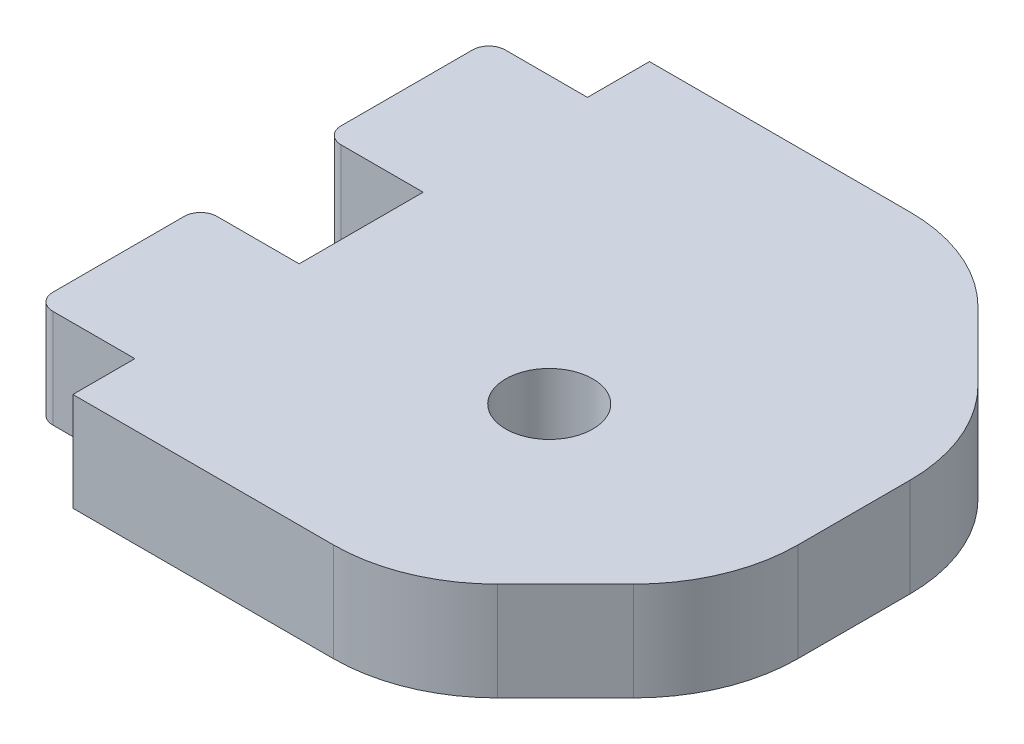
ISO-10303-21;
HEADER;
FILE_DESCRIPTION(('STEP AP214'),'2;1');
FILE_NAME('part.step','',(''),(''),'','','');
FILE_SCHEMA(('AUTOMOTIVE_DESIGN { 1 0 10303 214 1 1 1 1 }'));
ENDSEC;
DATA;
#1=APPLICATION_CONTEXT('core data for automotive mechanical design processes');
#2=APPLICATION_PROTOCOL_DEFINITION('international standard','automotive_design',2000,#1);
#3=PRODUCT_CONTEXT('',#1,'mechanical');
#4=PRODUCT('Part','Part','',(#3));
#5=PRODUCT_RELATED_PRODUCT_CATEGORY('part','',(#4));
#6=PRODUCT_DEFINITION_FORMATION('','',#4);
#7=PRODUCT_DEFINITION_CONTEXT('part definition',#1,'design');
#8=PRODUCT_DEFINITION('design','',#6,#7);
#9=PRODUCT_DEFINITION_SHAPE('','',#8);
#10=(LENGTH_UNIT() NAMED_UNIT(*) SI_UNIT(.MILLI.,.METRE.));
#11=(NAMED_UNIT(*) PLANE_ANGLE_UNIT() SI_UNIT($,.RADIAN.));
#12=(NAMED_UNIT(*) SI_UNIT($,.STERADIAN.) SOLID_ANGLE_UNIT());
#13=UNCERTAINTY_MEASURE_WITH_UNIT(LENGTH_MEASURE(1.E-05),#10,'distance_accuracy_value','');
#14=(GEOMETRIC_REPRESENTATION_CONTEXT(3) GLOBAL_UNCERTAINTY_ASSIGNED_CONTEXT((#13)) GLOBAL_UNIT_ASSIGNED_CONTEXT((#10,
#11,#12)) REPRESENTATION_CONTEXT('',''));
#15=CARTESIAN_POINT('',(0.,0.,0.));
#16=DIRECTION('',(0.,0.,1.));
#17=DIRECTION('',(1.,0.,0.));
#18=AXIS2_PLACEMENT_3D('',#15,#16,#17);
#19=CARTESIAN_POINT('',(0.,6.,0.));
#20=DIRECTION('',(1.,0.,0.));
#21=DIRECTION('',(0.,0.,-1.));
#22=AXIS2_PLACEMENT_3D('',#19,#20,#21);
#23=PLANE('',#22);
#24=DIRECTION('',(0.,1.,0.));
#25=VECTOR('',#24,1.);
#26=CARTESIAN_POINT('',(0.,5.99999999999999,-21.325));
#27=LINE('',#26,#25);
#28=CARTESIAN_POINT('',(0.,0.,-21.325));
#29=VERTEX_POINT('',#28);
#30=CARTESIAN_POINT('',(0.,6.,-21.325));
#31=VERTEX_POINT('',#30);
#32=EDGE_CURVE('E190',#29,#31,#27,.T.);
#33=ORIENTED_EDGE('',*,*,#32,.F.);
#34=DIRECTION('',(0.,0.,1.));
#35=VECTOR('',#34,1.);
#36=CARTESIAN_POINT('',(0.,0.,0.));
#37=LINE('',#36,#35);
#38=CARTESIAN_POINT('',(0.,0.,-13.775));
#39=VERTEX_POINT('',#38);
#40=EDGE_CURVE('E198',#29,#39,#37,.T.);
#41=ORIENTED_EDGE('',*,*,#40,.T.);
#42=DIRECTION('',(0.,-1.,0.));
#43=VECTOR('',#42,1.);
#44=CARTESIAN_POINT('',(0.,0.,-13.775));
#45=LINE('',#44,#43);
#46=CARTESIAN_POINT('',(0.,6.,-13.775));
#47=VERTEX_POINT('',#46);
#48=EDGE_CURVE('E224',#47,#39,#45,.T.);
#49=ORIENTED_EDGE('',*,*,#48,.F.);
#50=DIRECTION('',(0.,0.,1.));
#51=VECTOR('',#50,1.);
#52=CARTESIAN_POINT('',(0.,6.,0.));
#53=LINE('',#52,#51);
#54=EDGE_CURVE('E210',#31,#47,#53,.T.);
#55=ORIENTED_EDGE('',*,*,#54,.F.);
#56=EDGE_LOOP('',(#33,#41,#49,#55));
#57=FACE_BOUND('',#56,.T.);
#58=ADVANCED_FACE('F33',(#57),#23,.F.);
#59=DIRECTION('',(0.,-1.,0.));
#60=VECTOR('',#59,1.);
#61=CARTESIAN_POINT('',(0.,5.99999999999999,-31.325));
#62=LINE('',#61,#60);
#63=CARTESIAN_POINT('',(0.,6.,-31.325));
#64=VERTEX_POINT('',#63);
#65=CARTESIAN_POINT('',(0.,0.,-31.325));
#66=VERTEX_POINT('',#65);
#67=EDGE_CURVE('E211',#64,#66,#62,.T.);
#68=ORIENTED_EDGE('',*,*,#67,.F.);
#69=CARTESIAN_POINT('',(0.,6.,-35.1));
#70=VERTEX_POINT('',#69);
#71=EDGE_CURVE('E373',#70,#64,#53,.T.);
#72=ORIENTED_EDGE('',*,*,#71,.F.);
#73=DIRECTION('',(0.,-1.,0.));
#74=VECTOR('',#73,1.);
#75=CARTESIAN_POINT('',(0.,6.,-35.1));
#76=LINE('',#75,#74);
#77=CARTESIAN_POINT('',(0.,0.,-35.1));
#78=VERTEX_POINT('',#77);
#79=EDGE_CURVE('E304',#70,#78,#76,.T.);
#80=ORIENTED_EDGE('',*,*,#79,.T.);
#81=EDGE_CURVE('E206',#78,#66,#37,.T.);
#82=ORIENTED_EDGE('',*,*,#81,.T.);
#83=EDGE_LOOP('',(#68,#72,#80,#82));
#84=FACE_BOUND('',#83,.T.);
#85=ADVANCED_FACE('F411',(#84),#23,.F.);
#86=DIRECTION('',(0.,1.,0.));
#87=VECTOR('',#86,1.);
#88=CARTESIAN_POINT('',(0.,0.,-3.77500000000003));
#89=LINE('',#88,#87);
#90=CARTESIAN_POINT('',(0.,0.,-3.77500000000003));
#91=VERTEX_POINT('',#90);
#92=CARTESIAN_POINT('',(0.,6.,-3.77500000000003));
#93=VERTEX_POINT('',#92);
#94=EDGE_CURVE('E229',#91,#93,#89,.T.);
#95=ORIENTED_EDGE('',*,*,#94,.F.);
#96=CARTESIAN_POINT('',(0.,0.,0.));
#97=VERTEX_POINT('',#96);
#98=EDGE_CURVE('E207',#91,#97,#37,.T.);
#99=ORIENTED_EDGE('',*,*,#98,.T.);
#100=DIRECTION('',(0.,-1.,0.));
#101=VECTOR('',#100,1.);
#102=CARTESIAN_POINT('',(0.,6.,0.));
#103=LINE('',#102,#101);
#104=CARTESIAN_POINT('',(0.,6.,0.));
#105=VERTEX_POINT('',#104);
#106=EDGE_CURVE('E301',#105,#97,#103,.T.);
#107=ORIENTED_EDGE('',*,*,#106,.F.);
#108=EDGE_CURVE('E308',#93,#105,#53,.T.);
#109=ORIENTED_EDGE('',*,*,#108,.F.);
#110=EDGE_LOOP('',(#95,#99,#107,#109));
#111=FACE_BOUND('',#110,.T.);
#112=ADVANCED_FACE('F389',(#111),#23,.F.);
#113=CARTESIAN_POINT('',(0.,6.,0.));
#114=DIRECTION('',(0.,0.,-1.));
#115=DIRECTION('',(-1.,0.,0.));
#116=AXIS2_PLACEMENT_3D('',#113,#114,#115);
#117=PLANE('',#116);
#118=DIRECTION('',(1.,0.,0.));
#119=VECTOR('',#118,1.);
#120=CARTESIAN_POINT('',(0.,0.,0.));
#121=LINE('',#120,#119);
#122=CARTESIAN_POINT('',(15.857864376269,0.,0.));
#123=VERTEX_POINT('',#122);
#124=EDGE_CURVE('E282',#97,#123,#121,.T.);
#125=ORIENTED_EDGE('',*,*,#124,.T.);
#126=DIRECTION('',(0.,-1.,0.));
#127=VECTOR('',#126,1.);
#128=CARTESIAN_POINT('',(15.857864376269,6.,0.));
#129=LINE('',#128,#127);
#130=CARTESIAN_POINT('',(15.857864376269,6.,0.));
#131=VERTEX_POINT('',#130);
#132=EDGE_CURVE('E320',#123,#131,#129,.F.);
#133=ORIENTED_EDGE('',*,*,#132,.T.);
#134=DIRECTION('',(1.,0.,0.));
#135=VECTOR('',#134,1.);
#136=CARTESIAN_POINT('',(0.,6.,0.));
#137=LINE('',#136,#135);
#138=EDGE_CURVE('E372',#105,#131,#137,.T.);
#139=ORIENTED_EDGE('',*,*,#138,.F.);
#140=ORIENTED_EDGE('',*,*,#106,.T.);
#141=EDGE_LOOP('',(#125,#133,#139,#140));
#142=FACE_BOUND('',#141,.T.);
#143=ADVANCED_FACE('F318',(#142),#117,.F.);
#144=CARTESIAN_POINT('',(30.,6.,0.));
#145=DIRECTION('',(-1.,0.,0.));
#146=DIRECTION('',(0.,0.,1.));
#147=AXIS2_PLACEMENT_3D('',#144,#145,#146);
#148=PLANE('',#147);
#149=DIRECTION('',(0.,0.,-1.));
#150=VECTOR('',#149,1.);
#151=CARTESIAN_POINT('',(30.,6.,0.));
#152=LINE('',#151,#150);
#153=CARTESIAN_POINT('',(30.,6.,-14.142135623731));
#154=VERTEX_POINT('',#153);
#155=CARTESIAN_POINT('',(30.,6.,-20.9578643762691));
#156=VERTEX_POINT('',#155);
#157=EDGE_CURVE('E368',#154,#156,#152,.T.);
#158=ORIENTED_EDGE('',*,*,#157,.F.);
#159=DIRECTION('',(0.,1.,0.));
#160=VECTOR('',#159,1.);
#161=CARTESIAN_POINT('',(30.,0.,-14.142135623731));
#162=LINE('',#161,#160);
#163=CARTESIAN_POINT('',(30.,0.,-14.142135623731));
#164=VERTEX_POINT('',#163);
#165=EDGE_CURVE('E353',#154,#164,#162,.F.);
#166=ORIENTED_EDGE('',*,*,#165,.T.);
#167=DIRECTION('',(0.,0.,-1.));
#168=VECTOR('',#167,1.);
#169=CARTESIAN_POINT('',(30.,0.,0.));
#170=LINE('',#169,#168);
#171=CARTESIAN_POINT('',(30.,0.,-20.9578643762691));
#172=VERTEX_POINT('',#171);
#173=EDGE_CURVE('E309',#164,#172,#170,.T.);
#174=ORIENTED_EDGE('',*,*,#173,.T.);
#175=DIRECTION('',(0.,-1.,0.));
#176=VECTOR('',#175,1.);
#177=CARTESIAN_POINT('',(30.,6.,-20.9578643762691));
#178=LINE('',#177,#176);
#179=EDGE_CURVE('E351',#172,#156,#178,.F.);
#180=ORIENTED_EDGE('',*,*,#179,.T.);
#181=EDGE_LOOP('',(#158,#166,#174,#180));
#182=FACE_BOUND('',#181,.T.);
#183=ADVANCED_FACE('F367',(#182),#148,.F.);
#184=CARTESIAN_POINT('',(0.,6.,-35.1));
#185=DIRECTION('',(0.,0.,1.));
#186=DIRECTION('',(1.,0.,0.));
#187=AXIS2_PLACEMENT_3D('',#184,#185,#186);
#188=PLANE('',#187);
#189=DIRECTION('',(-1.,0.,0.));
#190=VECTOR('',#189,1.);
#191=CARTESIAN_POINT('',(0.,6.,-35.1));
#192=LINE('',#191,#190);
#193=CARTESIAN_POINT('',(15.857864376269,6.,-35.1));
#194=VERTEX_POINT('',#193);
#195=EDGE_CURVE('E280',#194,#70,#192,.T.);
#196=ORIENTED_EDGE('',*,*,#195,.F.);
#197=DIRECTION('',(0.,1.,0.));
#198=VECTOR('',#197,1.);
#199=CARTESIAN_POINT('',(15.857864376269,0.,-35.1));
#200=LINE('',#199,#198);
#201=CARTESIAN_POINT('',(15.857864376269,0.,-35.1));
#202=VERTEX_POINT('',#201);
#203=EDGE_CURVE('E11',#194,#202,#200,.F.);
#204=ORIENTED_EDGE('',*,*,#203,.T.);
#205=DIRECTION('',(-1.,0.,0.));
#206=VECTOR('',#205,1.);
#207=CARTESIAN_POINT('',(0.,0.,-35.1));
#208=LINE('',#207,#206);
#209=EDGE_CURVE('E307',#202,#78,#208,.T.);
#210=ORIENTED_EDGE('',*,*,#209,.T.);
#211=ORIENTED_EDGE('',*,*,#79,.F.);
#212=EDGE_LOOP('',(#196,#204,#210,#211));
#213=FACE_BOUND('',#212,.T.);
#214=ADVANCED_FACE('F407',(#213),#188,.F.);
#215=CARTESIAN_POINT('',(0.,6.,0.));
#216=DIRECTION('',(0.,-1.,0.));
#217=DIRECTION('',(0.,0.,-1.));
#218=AXIS2_PLACEMENT_3D('',#215,#216,#217);
#219=PLANE('',#218);
#220=CARTESIAN_POINT('',(15.0000000000003,6.,-13.9999999999997));
#221=DIRECTION('',(0.,-1.,0.));
#222=DIRECTION('',(0.,0.,-1.));
#223=AXIS2_PLACEMENT_3D('',#220,#221,#222);
#224=CIRCLE('',#223,2.65);
#225=CARTESIAN_POINT('',(15.0000000000003,6.,-16.6499999999997));
#226=VERTEX_POINT('',#225);
#227=EDGE_CURVE('E377',#226,#226,#224,.T.);
#228=ORIENTED_EDGE('',*,*,#227,.T.);
#229=EDGE_LOOP('',(#228));
#230=FACE_BOUND('',#229,.T.);
#231=ORIENTED_EDGE('',*,*,#138,.T.);
#232=CARTESIAN_POINT('',(15.857864376269,6.,-10.));
#233=DIRECTION('',(0.,-1.,0.));
#234=DIRECTION('',(0.,0.,-1.));
#235=AXIS2_PLACEMENT_3D('',#232,#233,#234);
#236=CIRCLE('',#235,10.);
#237=CARTESIAN_POINT('',(22.9289321881345,6.,-2.92893218813451));
#238=VERTEX_POINT('',#237);
#239=EDGE_CURVE('E329',#131,#238,#236,.F.);
#240=ORIENTED_EDGE('',*,*,#239,.T.);
#241=DIRECTION('',(-0.707106781186549,0.,0.707106781186546));
#242=VECTOR('',#241,1.);
#243=CARTESIAN_POINT('',(30.,6.,-10.));
#244=LINE('',#243,#242);
#245=CARTESIAN_POINT('',(27.0710678118655,6.,-7.07106781186547));
#246=VERTEX_POINT('',#245);
#247=EDGE_CURVE('E294',#238,#246,#244,.F.);
#248=ORIENTED_EDGE('',*,*,#247,.T.);
#249=CARTESIAN_POINT('',(20.,6.,-14.142135623731));
#250=DIRECTION('',(0.,-1.,0.));
#251=DIRECTION('',(0.,0.,-1.));
#252=AXIS2_PLACEMENT_3D('',#249,#250,#251);
#253=CIRCLE('',#252,10.);
#254=EDGE_CURVE('E339',#246,#154,#253,.F.);
#255=ORIENTED_EDGE('',*,*,#254,.T.);
#256=ORIENTED_EDGE('',*,*,#157,.T.);
#257=CARTESIAN_POINT('',(20.,6.,-20.9578643762691));
#258=DIRECTION('',(0.,-1.,0.));
#259=DIRECTION('',(0.,0.,-1.));
#260=AXIS2_PLACEMENT_3D('',#257,#258,#259);
#261=CIRCLE('',#260,10.);
#262=CARTESIAN_POINT('',(27.0710678118655,6.,-28.0289321881345));
#263=VERTEX_POINT('',#262);
#264=EDGE_CURVE('E332',#156,#263,#261,.F.);
#265=ORIENTED_EDGE('',*,*,#264,.T.);
#266=DIRECTION('',(0.707106781186546,0.,0.707106781186549));
#267=VECTOR('',#266,1.);
#268=CARTESIAN_POINT('',(20.,6.,-35.1));
#269=LINE('',#268,#267);
#270=CARTESIAN_POINT('',(22.9289321881345,6.,-32.1710678118655));
#271=VERTEX_POINT('',#270);
#272=EDGE_CURVE('E291',#263,#271,#269,.F.);
#273=ORIENTED_EDGE('',*,*,#272,.T.);
#274=CARTESIAN_POINT('',(15.857864376269,6.,-25.1));
#275=DIRECTION('',(0.,-1.,0.));
#276=DIRECTION('',(0.,0.,-1.));
#277=AXIS2_PLACEMENT_3D('',#274,#275,#276);
#278=CIRCLE('',#277,10.);
#279=EDGE_CURVE('E330',#271,#194,#278,.F.);
#280=ORIENTED_EDGE('',*,*,#279,.T.);
#281=ORIENTED_EDGE('',*,*,#195,.T.);
#282=ORIENTED_EDGE('',*,*,#71,.T.);
#283=DIRECTION('',(1.,0.,0.));
#284=VECTOR('',#283,1.);
#285=CARTESIAN_POINT('',(-6.,5.99999999999999,-31.325));
#286=LINE('',#285,#284);
#287=CARTESIAN_POINT('',(-5.,5.99999999999999,-31.325));
#288=VERTEX_POINT('',#287);
#289=EDGE_CURVE('E220',#288,#64,#286,.T.);
#290=ORIENTED_EDGE('',*,*,#289,.F.);
#291=CARTESIAN_POINT('',(-5.,6.,-30.325));
#292=DIRECTION('',(0.,-1.,0.));
#293=DIRECTION('',(0.,0.,-1.));
#294=AXIS2_PLACEMENT_3D('',#291,#292,#293);
#295=CIRCLE('',#294,1.);
#296=CARTESIAN_POINT('',(-6.,5.99999999999999,-30.325));
#297=VERTEX_POINT('',#296);
#298=EDGE_CURVE('E334',#288,#297,#295,.F.);
#299=ORIENTED_EDGE('',*,*,#298,.T.);
#300=DIRECTION('',(0.,0.,-1.));
#301=VECTOR('',#300,1.);
#302=CARTESIAN_POINT('',(-6.,5.99999999999999,-31.325));
#303=LINE('',#302,#301);
#304=CARTESIAN_POINT('',(-6.,5.99999999999999,-22.325));
#305=VERTEX_POINT('',#304);
#306=EDGE_CURVE('E214',#305,#297,#303,.T.);
#307=ORIENTED_EDGE('',*,*,#306,.F.);
#308=CARTESIAN_POINT('',(-5.,6.,-22.325));
#309=DIRECTION('',(0.,-1.,0.));
#310=DIRECTION('',(0.,0.,-1.));
#311=AXIS2_PLACEMENT_3D('',#308,#309,#310);
#312=CIRCLE('',#311,1.);
#313=CARTESIAN_POINT('',(-5.,5.99999999999999,-21.325));
#314=VERTEX_POINT('',#313);
#315=EDGE_CURVE('E521',#305,#314,#312,.F.);
#316=ORIENTED_EDGE('',*,*,#315,.T.);
#317=DIRECTION('',(1.,0.,0.));
#318=VECTOR('',#317,1.);
#319=CARTESIAN_POINT('',(-6.,5.99999999999999,-21.325));
#320=LINE('',#319,#318);
#321=EDGE_CURVE('E222',#314,#31,#320,.T.);
#322=ORIENTED_EDGE('',*,*,#321,.T.);
#323=ORIENTED_EDGE('',*,*,#54,.T.);
#324=DIRECTION('',(1.,0.,0.));
#325=VECTOR('',#324,1.);
#326=CARTESIAN_POINT('',(-6.,6.,-13.775));
#327=LINE('',#326,#325);
#328=CARTESIAN_POINT('',(-5.,6.,-13.775));
#329=VERTEX_POINT('',#328);
#330=EDGE_CURVE('E232',#329,#47,#327,.T.);
#331=ORIENTED_EDGE('',*,*,#330,.F.);
#332=CARTESIAN_POINT('',(-5.,6.,-12.775));
#333=DIRECTION('',(0.,-1.,0.));
#334=DIRECTION('',(0.,0.,-1.));
#335=AXIS2_PLACEMENT_3D('',#332,#333,#334);
#336=CIRCLE('',#335,1.);
#337=CARTESIAN_POINT('',(-6.,6.,-12.775));
#338=VERTEX_POINT('',#337);
#339=EDGE_CURVE('E254',#329,#338,#336,.F.);
#340=ORIENTED_EDGE('',*,*,#339,.T.);
#341=DIRECTION('',(0.,0.,-1.));
#342=VECTOR('',#341,1.);
#343=CARTESIAN_POINT('',(-6.,6.,-3.77500000000003));
#344=LINE('',#343,#342);
#345=CARTESIAN_POINT('',(-6.,6.,-4.77500000000003));
#346=VERTEX_POINT('',#345);
#347=EDGE_CURVE('E228',#346,#338,#344,.T.);
#348=ORIENTED_EDGE('',*,*,#347,.F.);
#349=CARTESIAN_POINT('',(-5.,6.,-4.77500000000003));
#350=DIRECTION('',(0.,-1.,0.));
#351=DIRECTION('',(0.,0.,-1.));
#352=AXIS2_PLACEMENT_3D('',#349,#350,#351);
#353=CIRCLE('',#352,1.);
#354=CARTESIAN_POINT('',(-5.,6.,-3.77500000000003));
#355=VERTEX_POINT('',#354);
#356=EDGE_CURVE('E262',#346,#355,#353,.F.);
#357=ORIENTED_EDGE('',*,*,#356,.T.);
#358=DIRECTION('',(1.,0.,0.));
#359=VECTOR('',#358,1.);
#360=CARTESIAN_POINT('',(-6.,6.,-3.77500000000003));
#361=LINE('',#360,#359);
#362=EDGE_CURVE('E249',#355,#93,#361,.T.);
#363=ORIENTED_EDGE('',*,*,#362,.T.);
#364=ORIENTED_EDGE('',*,*,#108,.T.);
#365=EDGE_LOOP('',(#231,#240,#248,#255,#256,#265,#273,#280,#281,#282,#290,#299,#307,#316,#322,
#323,#331,#340,#348,#357,#363,#364));
#366=FACE_BOUND('',#365,.T.);
#367=ADVANCED_FACE('F370',(#230,#366),#219,.F.);
#368=CARTESIAN_POINT('',(0.,0.,0.));
#369=DIRECTION('',(0.,-1.,0.));
#370=DIRECTION('',(0.,0.,-1.));
#371=AXIS2_PLACEMENT_3D('',#368,#369,#370);
#372=PLANE('',#371);
#373=CARTESIAN_POINT('',(15.0000000000003,0.,-13.9999999999997));
#374=DIRECTION('',(0.,-1.,0.));
#375=DIRECTION('',(0.,0.,-1.));
#376=AXIS2_PLACEMENT_3D('',#373,#374,#375);
#377=CIRCLE('',#376,2.65);
#378=CARTESIAN_POINT('',(15.0000000000003,0.,-16.6499999999997));
#379=VERTEX_POINT('',#378);
#380=EDGE_CURVE('E267',#379,#379,#377,.T.);
#381=ORIENTED_EDGE('',*,*,#380,.F.);
#382=EDGE_LOOP('',(#381));
#383=FACE_BOUND('',#382,.T.);
#384=DIRECTION('',(0.707106781186549,0.,-0.707106781186546));
#385=VECTOR('',#384,1.);
#386=CARTESIAN_POINT('',(9.99999999999994,0.,9.99999999999998));
#387=LINE('',#386,#385);
#388=CARTESIAN_POINT('',(27.0710678118655,0.,-7.07106781186548));
#389=VERTEX_POINT('',#388);
#390=CARTESIAN_POINT('',(22.9289321881345,0.,-2.92893218813451));
#391=VERTEX_POINT('',#390);
#392=EDGE_CURVE('E299',#389,#391,#387,.F.);
#393=ORIENTED_EDGE('',*,*,#392,.T.);
#394=CARTESIAN_POINT('',(15.857864376269,0.,-10.));
#395=DIRECTION('',(0.,-1.,0.));
#396=DIRECTION('',(0.,0.,-1.));
#397=AXIS2_PLACEMENT_3D('',#394,#395,#396);
#398=CIRCLE('',#397,10.);
#399=EDGE_CURVE('E328',#391,#123,#398,.T.);
#400=ORIENTED_EDGE('',*,*,#399,.T.);
#401=ORIENTED_EDGE('',*,*,#124,.F.);
#402=ORIENTED_EDGE('',*,*,#98,.F.);
#403=DIRECTION('',(1.,0.,0.));
#404=VECTOR('',#403,1.);
#405=CARTESIAN_POINT('',(-6.,0.,-3.77500000000003));
#406=LINE('',#405,#404);
#407=CARTESIAN_POINT('',(-5.,0.,-3.77500000000003));
#408=VERTEX_POINT('',#407);
#409=EDGE_CURVE('E253',#408,#91,#406,.T.);
#410=ORIENTED_EDGE('',*,*,#409,.F.);
#411=CARTESIAN_POINT('',(-5.,0.,-4.77500000000003));
#412=DIRECTION('',(0.,-1.,0.));
#413=DIRECTION('',(0.,0.,-1.));
#414=AXIS2_PLACEMENT_3D('',#411,#412,#413);
#415=CIRCLE('',#414,1.);
#416=CARTESIAN_POINT('',(-6.,0.,-4.77500000000003));
#417=VERTEX_POINT('',#416);
#418=EDGE_CURVE('E269',#408,#417,#415,.T.);
#419=ORIENTED_EDGE('',*,*,#418,.T.);
#420=DIRECTION('',(0.,0.,1.));
#421=VECTOR('',#420,1.);
#422=CARTESIAN_POINT('',(-6.,0.,-3.77500000000003));
#423=LINE('',#422,#421);
#424=CARTESIAN_POINT('',(-6.,0.,-12.775));
#425=VERTEX_POINT('',#424);
#426=EDGE_CURVE('E225',#425,#417,#423,.T.);
#427=ORIENTED_EDGE('',*,*,#426,.F.);
#428=CARTESIAN_POINT('',(-5.,0.,-12.775));
#429=DIRECTION('',(0.,-1.,0.));
#430=DIRECTION('',(0.,0.,-1.));
#431=AXIS2_PLACEMENT_3D('',#428,#429,#430);
#432=CIRCLE('',#431,1.);
#433=CARTESIAN_POINT('',(-5.,0.,-13.775));
#434=VERTEX_POINT('',#433);
#435=EDGE_CURVE('E265',#425,#434,#432,.T.);
#436=ORIENTED_EDGE('',*,*,#435,.T.);
#437=DIRECTION('',(1.,0.,0.));
#438=VECTOR('',#437,1.);
#439=CARTESIAN_POINT('',(-6.,0.,-13.775));
#440=LINE('',#439,#438);
#441=EDGE_CURVE('E202',#434,#39,#440,.T.);
#442=ORIENTED_EDGE('',*,*,#441,.T.);
#443=ORIENTED_EDGE('',*,*,#40,.F.);
#444=DIRECTION('',(1.,0.,0.));
#445=VECTOR('',#444,1.);
#446=CARTESIAN_POINT('',(-6.,0.,-21.325));
#447=LINE('',#446,#445);
#448=CARTESIAN_POINT('',(-5.,0.,-21.325));
#449=VERTEX_POINT('',#448);
#450=EDGE_CURVE('E185',#449,#29,#447,.T.);
#451=ORIENTED_EDGE('',*,*,#450,.F.);
#452=CARTESIAN_POINT('',(-5.,0.,-22.325));
#453=DIRECTION('',(0.,-1.,0.));
#454=DIRECTION('',(0.,0.,-1.));
#455=AXIS2_PLACEMENT_3D('',#452,#453,#454);
#456=CIRCLE('',#455,1.);
#457=CARTESIAN_POINT('',(-6.,0.,-22.325));
#458=VERTEX_POINT('',#457);
#459=EDGE_CURVE('E514',#449,#458,#456,.T.);
#460=ORIENTED_EDGE('',*,*,#459,.T.);
#461=DIRECTION('',(0.,0.,1.));
#462=VECTOR('',#461,1.);
#463=CARTESIAN_POINT('',(-6.,0.,-31.325));
#464=LINE('',#463,#462);
#465=CARTESIAN_POINT('',(-6.,0.,-30.325));
#466=VERTEX_POINT('',#465);
#467=EDGE_CURVE('E195',#466,#458,#464,.T.);
#468=ORIENTED_EDGE('',*,*,#467,.F.);
#469=CARTESIAN_POINT('',(-5.,0.,-30.325));
#470=DIRECTION('',(0.,-1.,0.));
#471=DIRECTION('',(0.,0.,-1.));
#472=AXIS2_PLACEMENT_3D('',#469,#470,#471);
#473=CIRCLE('',#472,1.);
#474=CARTESIAN_POINT('',(-5.,0.,-31.325));
#475=VERTEX_POINT('',#474);
#476=EDGE_CURVE('E513',#466,#475,#473,.T.);
#477=ORIENTED_EDGE('',*,*,#476,.T.);
#478=DIRECTION('',(1.,0.,0.));
#479=VECTOR('',#478,1.);
#480=CARTESIAN_POINT('',(-6.,0.,-31.325));
#481=LINE('',#480,#479);
#482=EDGE_CURVE('E194',#475,#66,#481,.T.);
#483=ORIENTED_EDGE('',*,*,#482,.T.);
#484=ORIENTED_EDGE('',*,*,#81,.F.);
#485=ORIENTED_EDGE('',*,*,#209,.F.);
#486=CARTESIAN_POINT('',(15.857864376269,0.,-25.1));
#487=DIRECTION('',(0.,-1.,0.));
#488=DIRECTION('',(0.,0.,-1.));
#489=AXIS2_PLACEMENT_3D('',#486,#487,#488);
#490=CIRCLE('',#489,10.);
#491=CARTESIAN_POINT('',(22.9289321881345,0.,-32.1710678118655));
#492=VERTEX_POINT('',#491);
#493=EDGE_CURVE('E346',#202,#492,#490,.T.);
#494=ORIENTED_EDGE('',*,*,#493,.T.);
#495=DIRECTION('',(-0.707106781186546,0.,-0.707106781186549));
#496=VECTOR('',#495,1.);
#497=CARTESIAN_POINT('',(27.5500000000001,0.,-27.5499999999999));
#498=LINE('',#497,#496);
#499=CARTESIAN_POINT('',(27.0710678118655,0.,-28.0289321881345));
#500=VERTEX_POINT('',#499);
#501=EDGE_CURVE('E297',#492,#500,#498,.F.);
#502=ORIENTED_EDGE('',*,*,#501,.T.);
#503=CARTESIAN_POINT('',(20.,0.,-20.9578643762691));
#504=DIRECTION('',(0.,-1.,0.));
#505=DIRECTION('',(0.,0.,-1.));
#506=AXIS2_PLACEMENT_3D('',#503,#504,#505);
#507=CIRCLE('',#506,10.);
#508=EDGE_CURVE('E48',#500,#172,#507,.T.);
#509=ORIENTED_EDGE('',*,*,#508,.T.);
#510=ORIENTED_EDGE('',*,*,#173,.F.);
#511=CARTESIAN_POINT('',(20.,0.,-14.142135623731));
#512=DIRECTION('',(0.,-1.,0.));
#513=DIRECTION('',(0.,0.,-1.));
#514=AXIS2_PLACEMENT_3D('',#511,#512,#513);
#515=CIRCLE('',#514,10.);
#516=EDGE_CURVE('E56',#164,#389,#515,.T.);
#517=ORIENTED_EDGE('',*,*,#516,.T.);
#518=EDGE_LOOP('',(#393,#400,#401,#402,#410,#419,#427,#436,#442,#443,#451,#460,#468,#477,#483,
#484,#485,#494,#502,#509,#510,#517));
#519=FACE_BOUND('',#518,.T.);
#520=ADVANCED_FACE('F200',(#383,#519),#372,.T.);
#521=CARTESIAN_POINT('',(20.,6.,-35.1));
#522=DIRECTION('',(-0.707106781186549,0.,0.707106781186546));
#523=DIRECTION('',(0.,-1.,0.));
#524=AXIS2_PLACEMENT_3D('',#521,#522,#523);
#525=PLANE('',#524);
#526=ORIENTED_EDGE('',*,*,#272,.F.);
#527=DIRECTION('',(0.,1.,0.));
#528=VECTOR('',#527,1.);
#529=CARTESIAN_POINT('',(27.0710678118655,0.,-28.0289321881345));
#530=LINE('',#529,#528);
#531=EDGE_CURVE('E41',#263,#500,#530,.F.);
#532=ORIENTED_EDGE('',*,*,#531,.T.);
#533=ORIENTED_EDGE('',*,*,#501,.F.);
#534=DIRECTION('',(0.,-1.,0.));
#535=VECTOR('',#534,1.);
#536=CARTESIAN_POINT('',(22.9289321881345,6.,-32.1710678118655));
#537=LINE('',#536,#535);
#538=EDGE_CURVE('E355',#492,#271,#537,.F.);
#539=ORIENTED_EDGE('',*,*,#538,.T.);
#540=EDGE_LOOP('',(#526,#532,#533,#539));
#541=FACE_BOUND('',#540,.T.);
#542=ADVANCED_FACE('F360',(#541),#525,.F.);
#543=CARTESIAN_POINT('',(30.,6.,-10.));
#544=DIRECTION('',(-0.707106781186546,0.,-0.707106781186549));
#545=DIRECTION('',(0.,-1.,0.));
#546=AXIS2_PLACEMENT_3D('',#543,#544,#545);
#547=PLANE('',#546);
#548=ORIENTED_EDGE('',*,*,#247,.F.);
#549=DIRECTION('',(0.,1.,0.));
#550=VECTOR('',#549,1.);
#551=CARTESIAN_POINT('',(22.9289321881345,0.,-2.92893218813451));
#552=LINE('',#551,#550);
#553=EDGE_CURVE('E344',#238,#391,#552,.F.);
#554=ORIENTED_EDGE('',*,*,#553,.T.);
#555=ORIENTED_EDGE('',*,*,#392,.F.);
#556=DIRECTION('',(0.,-1.,0.));
#557=VECTOR('',#556,1.);
#558=CARTESIAN_POINT('',(27.0710678118655,6.,-7.07106781186547));
#559=LINE('',#558,#557);
#560=EDGE_CURVE('E342',#389,#246,#559,.F.);
#561=ORIENTED_EDGE('',*,*,#560,.T.);
#562=EDGE_LOOP('',(#548,#554,#555,#561));
#563=FACE_BOUND('',#562,.T.);
#564=ADVANCED_FACE('F405',(#563),#547,.F.);
#565=CARTESIAN_POINT('',(15.0000000000003,0.,-13.9999999999997));
#566=DIRECTION('',(0.,-1.,0.));
#567=DIRECTION('',(0.,0.,-1.));
#568=AXIS2_PLACEMENT_3D('',#565,#566,#567);
#569=CYLINDRICAL_SURFACE('',#568,2.65);
#570=ORIENTED_EDGE('',*,*,#227,.F.);
#571=EDGE_LOOP('',(#570));
#572=FACE_BOUND('',#571,.T.);
#573=ORIENTED_EDGE('',*,*,#380,.T.);
#574=EDGE_LOOP('',(#573));
#575=FACE_BOUND('',#574,.T.);
#576=ADVANCED_FACE('F397',(#572,#575),#569,.F.);
#577=CARTESIAN_POINT('',(-6.,0.,-13.775));
#578=DIRECTION('',(0.,0.,1.));
#579=DIRECTION('',(1.,0.,0.));
#580=AXIS2_PLACEMENT_3D('',#577,#578,#579);
#581=PLANE('',#580);
#582=ORIENTED_EDGE('',*,*,#441,.F.);
#583=DIRECTION('',(0.,-1.,0.));
#584=VECTOR('',#583,1.);
#585=CARTESIAN_POINT('',(-5.,6.,-13.775));
#586=LINE('',#585,#584);
#587=EDGE_CURVE('E271',#434,#329,#586,.F.);
#588=ORIENTED_EDGE('',*,*,#587,.T.);
#589=ORIENTED_EDGE('',*,*,#330,.T.);
#590=ORIENTED_EDGE('',*,*,#48,.T.);
#591=EDGE_LOOP('',(#582,#588,#589,#590));
#592=FACE_BOUND('',#591,.T.);
#593=ADVANCED_FACE('F475',(#592),#581,.F.);
#594=CARTESIAN_POINT('',(-6.,0.,-3.77500000000003));
#595=DIRECTION('',(0.,0.,-1.));
#596=DIRECTION('',(0.,1.,0.));
#597=AXIS2_PLACEMENT_3D('',#594,#595,#596);
#598=PLANE('',#597);
#599=ORIENTED_EDGE('',*,*,#362,.F.);
#600=DIRECTION('',(0.,1.,0.));
#601=VECTOR('',#600,1.);
#602=CARTESIAN_POINT('',(-5.,0.,-3.77500000000003));
#603=LINE('',#602,#601);
#604=EDGE_CURVE('E263',#355,#408,#603,.F.);
#605=ORIENTED_EDGE('',*,*,#604,.T.);
#606=ORIENTED_EDGE('',*,*,#409,.T.);
#607=ORIENTED_EDGE('',*,*,#94,.T.);
#608=EDGE_LOOP('',(#599,#605,#606,#607));
#609=FACE_BOUND('',#608,.T.);
#610=ADVANCED_FACE('F482',(#609),#598,.F.);
#611=CARTESIAN_POINT('',(-6.,0.,0.));
#612=DIRECTION('',(-1.,0.,0.));
#613=DIRECTION('',(0.,0.,1.));
#614=AXIS2_PLACEMENT_3D('',#611,#612,#613);
#615=PLANE('',#614);
#616=ORIENTED_EDGE('',*,*,#426,.T.);
#617=DIRECTION('',(0.,1.,0.));
#618=VECTOR('',#617,1.);
#619=CARTESIAN_POINT('',(-6.,6.,-4.77500000000003));
#620=LINE('',#619,#618);
#621=EDGE_CURVE('E250',#417,#346,#620,.T.);
#622=ORIENTED_EDGE('',*,*,#621,.T.);
#623=ORIENTED_EDGE('',*,*,#347,.T.);
#624=DIRECTION('',(0.,-1.,0.));
#625=VECTOR('',#624,1.);
#626=CARTESIAN_POINT('',(-6.,0.,-12.775));
#627=LINE('',#626,#625);
#628=EDGE_CURVE('E244',#338,#425,#627,.T.);
#629=ORIENTED_EDGE('',*,*,#628,.T.);
#630=EDGE_LOOP('',(#616,#622,#623,#629));
#631=FACE_BOUND('',#630,.T.);
#632=ADVANCED_FACE('F467',(#631),#615,.T.);
#633=CARTESIAN_POINT('',(-5.,0.,-4.77500000000003));
#634=DIRECTION('',(0.,-1.,0.));
#635=DIRECTION('',(0.,0.,-1.));
#636=AXIS2_PLACEMENT_3D('',#633,#634,#635);
#637=CYLINDRICAL_SURFACE('',#636,1.);
#638=ORIENTED_EDGE('',*,*,#418,.F.);
#639=ORIENTED_EDGE('',*,*,#604,.F.);
#640=ORIENTED_EDGE('',*,*,#356,.F.);
#641=ORIENTED_EDGE('',*,*,#621,.F.);
#642=EDGE_LOOP('',(#638,#639,#640,#641));
#643=FACE_BOUND('',#642,.T.);
#644=ADVANCED_FACE('F463',(#643),#637,.T.);
#645=CARTESIAN_POINT('',(-5.,0.,-12.775));
#646=DIRECTION('',(0.,1.,0.));
#647=DIRECTION('',(-1.,0.,0.));
#648=AXIS2_PLACEMENT_3D('',#645,#646,#647);
#649=CYLINDRICAL_SURFACE('',#648,1.);
#650=ORIENTED_EDGE('',*,*,#339,.F.);
#651=ORIENTED_EDGE('',*,*,#587,.F.);
#652=ORIENTED_EDGE('',*,*,#435,.F.);
#653=ORIENTED_EDGE('',*,*,#628,.F.);
#654=EDGE_LOOP('',(#650,#651,#652,#653));
#655=FACE_BOUND('',#654,.T.);
#656=ADVANCED_FACE('F460',(#655),#649,.T.);
#657=CARTESIAN_POINT('',(-6.,5.99999999999999,-21.325));
#658=DIRECTION('',(0.,0.,-1.));
#659=DIRECTION('',(-1.,0.,0.));
#660=AXIS2_PLACEMENT_3D('',#657,#658,#659);
#661=PLANE('',#660);
#662=ORIENTED_EDGE('',*,*,#321,.F.);
#663=DIRECTION('',(0.,1.,0.));
#664=VECTOR('',#663,1.);
#665=CARTESIAN_POINT('',(-5.,0.,-21.325));
#666=LINE('',#665,#664);
#667=EDGE_CURVE('E192',#314,#449,#666,.F.);
#668=ORIENTED_EDGE('',*,*,#667,.T.);
#669=ORIENTED_EDGE('',*,*,#450,.T.);
#670=ORIENTED_EDGE('',*,*,#32,.T.);
#671=EDGE_LOOP('',(#662,#668,#669,#670));
#672=FACE_BOUND('',#671,.T.);
#673=ADVANCED_FACE('F188',(#672),#661,.F.);
#674=CARTESIAN_POINT('',(-6.,5.99999999999999,-31.325));
#675=DIRECTION('',(0.,0.,1.));
#676=DIRECTION('',(1.,0.,0.));
#677=AXIS2_PLACEMENT_3D('',#674,#675,#676);
#678=PLANE('',#677);
#679=ORIENTED_EDGE('',*,*,#482,.F.);
#680=DIRECTION('',(0.,-1.,0.));
#681=VECTOR('',#680,1.);
#682=CARTESIAN_POINT('',(-5.,5.99999999999999,-31.325));
#683=LINE('',#682,#681);
#684=EDGE_CURVE('E519',#475,#288,#683,.F.);
#685=ORIENTED_EDGE('',*,*,#684,.T.);
#686=ORIENTED_EDGE('',*,*,#289,.T.);
#687=ORIENTED_EDGE('',*,*,#67,.T.);
#688=EDGE_LOOP('',(#679,#685,#686,#687));
#689=FACE_BOUND('',#688,.T.);
#690=ADVANCED_FACE('F494',(#689),#678,.F.);
#691=CARTESIAN_POINT('',(-6.,0.,0.));
#692=DIRECTION('',(-1.,0.,0.));
#693=DIRECTION('',(0.,0.,1.));
#694=AXIS2_PLACEMENT_3D('',#691,#692,#693);
#695=PLANE('',#694);
#696=ORIENTED_EDGE('',*,*,#306,.T.);
#697=DIRECTION('',(0.,-1.,0.));
#698=VECTOR('',#697,1.);
#699=CARTESIAN_POINT('',(-6.,0.,-30.325));
#700=LINE('',#699,#698);
#701=EDGE_CURVE('E508',#297,#466,#700,.T.);
#702=ORIENTED_EDGE('',*,*,#701,.T.);
#703=ORIENTED_EDGE('',*,*,#467,.T.);
#704=DIRECTION('',(0.,1.,0.));
#705=VECTOR('',#704,1.);
#706=CARTESIAN_POINT('',(-6.,5.99999999999999,-22.325));
#707=LINE('',#706,#705);
#708=EDGE_CURVE('E272',#458,#305,#707,.T.);
#709=ORIENTED_EDGE('',*,*,#708,.T.);
#710=EDGE_LOOP('',(#696,#702,#703,#709));
#711=FACE_BOUND('',#710,.T.);
#712=ADVANCED_FACE('F458',(#711),#695,.T.);
#713=CARTESIAN_POINT('',(-5.,0.,-30.325));
#714=DIRECTION('',(0.,1.,0.));
#715=DIRECTION('',(-1.,0.,0.));
#716=AXIS2_PLACEMENT_3D('',#713,#714,#715);
#717=CYLINDRICAL_SURFACE('',#716,1.);
#718=ORIENTED_EDGE('',*,*,#298,.F.);
#719=ORIENTED_EDGE('',*,*,#684,.F.);
#720=ORIENTED_EDGE('',*,*,#476,.F.);
#721=ORIENTED_EDGE('',*,*,#701,.F.);
#722=EDGE_LOOP('',(#718,#719,#720,#721));
#723=FACE_BOUND('',#722,.T.);
#724=ADVANCED_FACE('F454',(#723),#717,.T.);
#725=CARTESIAN_POINT('',(-5.,0.,-22.325));
#726=DIRECTION('',(0.,-1.,0.));
#727=DIRECTION('',(1.,0.,0.));
#728=AXIS2_PLACEMENT_3D('',#725,#726,#727);
#729=CYLINDRICAL_SURFACE('',#728,1.);
#730=ORIENTED_EDGE('',*,*,#459,.F.);
#731=ORIENTED_EDGE('',*,*,#667,.F.);
#732=ORIENTED_EDGE('',*,*,#315,.F.);
#733=ORIENTED_EDGE('',*,*,#708,.F.);
#734=EDGE_LOOP('',(#730,#731,#732,#733));
#735=FACE_BOUND('',#734,.T.);
#736=ADVANCED_FACE('F451',(#735),#729,.T.);
#737=CARTESIAN_POINT('',(15.857864376269,6.,-10.));
#738=DIRECTION('',(0.,1.,0.));
#739=DIRECTION('',(0.,0.,1.));
#740=AXIS2_PLACEMENT_3D('',#737,#738,#739);
#741=CYLINDRICAL_SURFACE('',#740,10.);
#742=ORIENTED_EDGE('',*,*,#399,.F.);
#743=ORIENTED_EDGE('',*,*,#553,.F.);
#744=ORIENTED_EDGE('',*,*,#239,.F.);
#745=ORIENTED_EDGE('',*,*,#132,.F.);
#746=EDGE_LOOP('',(#742,#743,#744,#745));
#747=FACE_BOUND('',#746,.T.);
#748=ADVANCED_FACE('F326',(#747),#741,.T.);
#749=CARTESIAN_POINT('',(20.,6.,-14.142135623731));
#750=DIRECTION('',(0.,-1.,0.));
#751=DIRECTION('',(0.,0.,-1.));
#752=AXIS2_PLACEMENT_3D('',#749,#750,#751);
#753=CYLINDRICAL_SURFACE('',#752,10.);
#754=ORIENTED_EDGE('',*,*,#254,.F.);
#755=ORIENTED_EDGE('',*,*,#560,.F.);
#756=ORIENTED_EDGE('',*,*,#516,.F.);
#757=ORIENTED_EDGE('',*,*,#165,.F.);
#758=EDGE_LOOP('',(#754,#755,#756,#757));
#759=FACE_BOUND('',#758,.T.);
#760=ADVANCED_FACE('F443',(#759),#753,.T.);
#761=CARTESIAN_POINT('',(20.,6.,-20.9578643762691));
#762=DIRECTION('',(0.,1.,0.));
#763=DIRECTION('',(0.,0.,1.));
#764=AXIS2_PLACEMENT_3D('',#761,#762,#763);
#765=CYLINDRICAL_SURFACE('',#764,10.);
#766=ORIENTED_EDGE('',*,*,#508,.F.);
#767=ORIENTED_EDGE('',*,*,#531,.F.);
#768=ORIENTED_EDGE('',*,*,#264,.F.);
#769=ORIENTED_EDGE('',*,*,#179,.F.);
#770=EDGE_LOOP('',(#766,#767,#768,#769));
#771=FACE_BOUND('',#770,.T.);
#772=ADVANCED_FACE('F364',(#771),#765,.T.);
#773=CARTESIAN_POINT('',(15.857864376269,6.,-25.1));
#774=DIRECTION('',(0.,-1.,0.));
#775=DIRECTION('',(0.,0.,-1.));
#776=AXIS2_PLACEMENT_3D('',#773,#774,#775);
#777=CYLINDRICAL_SURFACE('',#776,10.);
#778=ORIENTED_EDGE('',*,*,#279,.F.);
#779=ORIENTED_EDGE('',*,*,#538,.F.);
#780=ORIENTED_EDGE('',*,*,#493,.F.);
#781=ORIENTED_EDGE('',*,*,#203,.F.);
#782=EDGE_LOOP('',(#778,#779,#780,#781));
#783=FACE_BOUND('',#782,.T.);
#784=ADVANCED_FACE('F35',(#783),#777,.T.);
#785=CLOSED_SHELL('',(#58,#85,#112,#143,#183,#214,#367,#520,#542,#564,#576,#593,#610,#632,#644,
#656,#673,#690,#712,#724,#736,#748,#760,#772,#784));
#786=MANIFOLD_SOLID_BREP('B2',#785);
#787=ADVANCED_BREP_SHAPE_REPRESENTATION('',(#18,#786),#14);
#788=SHAPE_DEFINITION_REPRESENTATION(#9,#787);
ENDSEC;
END-ISO-10303-21;
